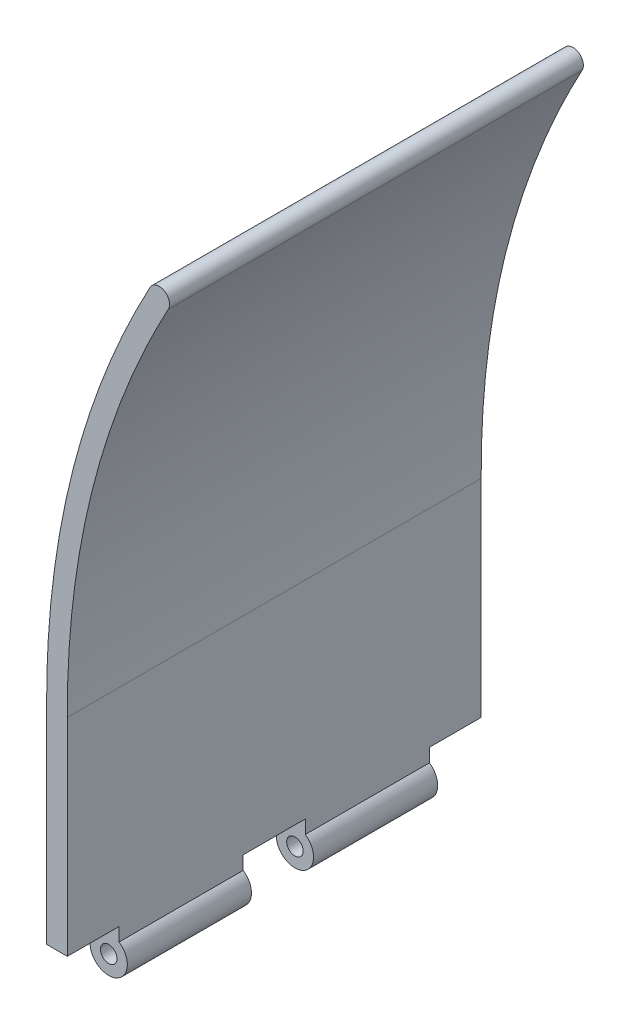
ISO-10303-21;
HEADER;
FILE_DESCRIPTION(('STEP AP214'),'2;1');
FILE_NAME('part.step','',(''),(''),'','','');
FILE_SCHEMA(('AUTOMOTIVE_DESIGN { 1 0 10303 214 1 1 1 1 }'));
ENDSEC;
DATA;
#1=APPLICATION_CONTEXT('core data for automotive mechanical design processes');
#2=APPLICATION_PROTOCOL_DEFINITION('international standard','automotive_design',2000,#1);
#3=PRODUCT_CONTEXT('',#1,'mechanical');
#4=PRODUCT('Part','Part','',(#3));
#5=PRODUCT_RELATED_PRODUCT_CATEGORY('part','',(#4));
#6=PRODUCT_DEFINITION_FORMATION('','',#4);
#7=PRODUCT_DEFINITION_CONTEXT('part definition',#1,'design');
#8=PRODUCT_DEFINITION('design','',#6,#7);
#9=PRODUCT_DEFINITION_SHAPE('','',#8);
#10=(LENGTH_UNIT() NAMED_UNIT(*) SI_UNIT(.MILLI.,.METRE.));
#11=(NAMED_UNIT(*) PLANE_ANGLE_UNIT() SI_UNIT($,.RADIAN.));
#12=(NAMED_UNIT(*) SI_UNIT($,.STERADIAN.) SOLID_ANGLE_UNIT());
#13=UNCERTAINTY_MEASURE_WITH_UNIT(LENGTH_MEASURE(1.E-05),#10,'distance_accuracy_value','');
#14=(GEOMETRIC_REPRESENTATION_CONTEXT(3) GLOBAL_UNCERTAINTY_ASSIGNED_CONTEXT((#13)) GLOBAL_UNIT_ASSIGNED_CONTEXT((#10,
#11,#12)) REPRESENTATION_CONTEXT('',''));
#15=CARTESIAN_POINT('',(0.,0.,0.));
#16=DIRECTION('',(0.,0.,1.));
#17=DIRECTION('',(1.,0.,0.));
#18=AXIS2_PLACEMENT_3D('',#15,#16,#17);
#19=CARTESIAN_POINT('',(0.,0.,50.));
#20=DIRECTION('',(0.,1.,0.));
#21=DIRECTION('',(0.,0.,1.));
#22=AXIS2_PLACEMENT_3D('',#19,#20,#21);
#23=PLANE('',#22);
#24=DIRECTION('',(1.,0.,0.));
#25=VECTOR('',#24,1.);
#26=CARTESIAN_POINT('',(0.,0.,-7.50000000000001));
#27=LINE('',#26,#25);
#28=CARTESIAN_POINT('',(0.,0.,-7.50000000000001));
#29=VERTEX_POINT('',#28);
#30=CARTESIAN_POINT('',(5.,0.,-7.50000000000001));
#31=VERTEX_POINT('',#30);
#32=EDGE_CURVE('E60',#29,#31,#27,.T.);
#33=ORIENTED_EDGE('',*,*,#32,.T.);
#34=DIRECTION('',(0.,0.,-1.));
#35=VECTOR('',#34,1.);
#36=CARTESIAN_POINT('',(5.,0.,50.));
#37=LINE('',#36,#35);
#38=CARTESIAN_POINT('',(5.,0.,7.50000000000001));
#39=VERTEX_POINT('',#38);
#40=EDGE_CURVE('E45',#39,#31,#37,.T.);
#41=ORIENTED_EDGE('',*,*,#40,.F.);
#42=DIRECTION('',(1.,0.,0.));
#43=VECTOR('',#42,1.);
#44=CARTESIAN_POINT('',(0.,0.,7.50000000000001));
#45=LINE('',#44,#43);
#46=CARTESIAN_POINT('',(0.,0.,7.50000000000001));
#47=VERTEX_POINT('',#46);
#48=EDGE_CURVE('E193',#47,#39,#45,.T.);
#49=ORIENTED_EDGE('',*,*,#48,.F.);
#50=DIRECTION('',(0.,0.,-1.));
#51=VECTOR('',#50,1.);
#52=CARTESIAN_POINT('',(0.,0.,50.));
#53=LINE('',#52,#51);
#54=EDGE_CURVE('E419',#47,#29,#53,.T.);
#55=ORIENTED_EDGE('',*,*,#54,.T.);
#56=EDGE_LOOP('',(#33,#41,#49,#55));
#57=FACE_BOUND('',#56,.T.);
#58=ADVANCED_FACE('F37',(#57),#23,.F.);
#59=CARTESIAN_POINT('',(5.,0.,-37.5));
#60=VERTEX_POINT('',#59);
#61=CARTESIAN_POINT('',(5.,0.,-50.));
#62=VERTEX_POINT('',#61);
#63=EDGE_CURVE('E46',#60,#62,#37,.T.);
#64=ORIENTED_EDGE('',*,*,#63,.F.);
#65=DIRECTION('',(1.,0.,0.));
#66=VECTOR('',#65,1.);
#67=CARTESIAN_POINT('',(0.,0.,-37.5));
#68=LINE('',#67,#66);
#69=CARTESIAN_POINT('',(0.,0.,-37.5));
#70=VERTEX_POINT('',#69);
#71=EDGE_CURVE('E177',#70,#60,#68,.T.);
#72=ORIENTED_EDGE('',*,*,#71,.F.);
#73=CARTESIAN_POINT('',(0.,0.,-50.));
#74=VERTEX_POINT('',#73);
#75=EDGE_CURVE('E395',#70,#74,#53,.T.);
#76=ORIENTED_EDGE('',*,*,#75,.T.);
#77=DIRECTION('',(1.,0.,0.));
#78=VECTOR('',#77,1.);
#79=CARTESIAN_POINT('',(0.,0.,-50.));
#80=LINE('',#79,#78);
#81=EDGE_CURVE('E214',#74,#62,#80,.T.);
#82=ORIENTED_EDGE('',*,*,#81,.T.);
#83=EDGE_LOOP('',(#64,#72,#76,#82));
#84=FACE_BOUND('',#83,.T.);
#85=ADVANCED_FACE('F245',(#84),#23,.F.);
#86=CARTESIAN_POINT('',(0.,0.,50.));
#87=VERTEX_POINT('',#86);
#88=CARTESIAN_POINT('',(0.,0.,37.5));
#89=VERTEX_POINT('',#88);
#90=EDGE_CURVE('E416',#87,#89,#53,.T.);
#91=ORIENTED_EDGE('',*,*,#90,.T.);
#92=DIRECTION('',(1.,0.,0.));
#93=VECTOR('',#92,1.);
#94=CARTESIAN_POINT('',(0.,0.,37.5));
#95=LINE('',#94,#93);
#96=CARTESIAN_POINT('',(5.,0.,37.5));
#97=VERTEX_POINT('',#96);
#98=EDGE_CURVE('E208',#89,#97,#95,.T.);
#99=ORIENTED_EDGE('',*,*,#98,.T.);
#100=CARTESIAN_POINT('',(5.,0.,50.));
#101=VERTEX_POINT('',#100);
#102=EDGE_CURVE('E11',#101,#97,#37,.T.);
#103=ORIENTED_EDGE('',*,*,#102,.F.);
#104=DIRECTION('',(1.,0.,0.));
#105=VECTOR('',#104,1.);
#106=CARTESIAN_POINT('',(0.,0.,50.));
#107=LINE('',#106,#105);
#108=EDGE_CURVE('E216',#87,#101,#107,.T.);
#109=ORIENTED_EDGE('',*,*,#108,.F.);
#110=EDGE_LOOP('',(#91,#99,#103,#109));
#111=FACE_BOUND('',#110,.T.);
#112=ADVANCED_FACE('F39',(#111),#23,.F.);
#113=CARTESIAN_POINT('',(5.,0.,50.));
#114=DIRECTION('',(-1.,0.,0.));
#115=DIRECTION('',(0.,-1.,0.));
#116=AXIS2_PLACEMENT_3D('',#113,#114,#115);
#117=PLANE('',#116);
#118=DIRECTION('',(0.,1.,0.));
#119=VECTOR('',#118,1.);
#120=CARTESIAN_POINT('',(5.,0.,-50.));
#121=LINE('',#120,#119);
#122=CARTESIAN_POINT('',(5.,50.0110730492752,-50.));
#123=VERTEX_POINT('',#122);
#124=EDGE_CURVE('E397',#62,#123,#121,.T.);
#125=ORIENTED_EDGE('',*,*,#124,.T.);
#126=DIRECTION('',(0.,0.,-1.));
#127=VECTOR('',#126,1.);
#128=CARTESIAN_POINT('',(5.,50.0110730492752,50.));
#129=LINE('',#128,#127);
#130=CARTESIAN_POINT('',(5.,50.0110730492752,50.));
#131=VERTEX_POINT('',#130);
#132=EDGE_CURVE('E427',#131,#123,#129,.T.);
#133=ORIENTED_EDGE('',*,*,#132,.F.);
#134=DIRECTION('',(0.,1.,0.));
#135=VECTOR('',#134,1.);
#136=CARTESIAN_POINT('',(5.,0.,50.));
#137=LINE('',#136,#135);
#138=EDGE_CURVE('E219',#101,#131,#137,.T.);
#139=ORIENTED_EDGE('',*,*,#138,.F.);
#140=ORIENTED_EDGE('',*,*,#102,.T.);
#141=DIRECTION('',(0.,1.,0.));
#142=VECTOR('',#141,1.);
#143=CARTESIAN_POINT('',(5.,0.,37.5));
#144=LINE('',#143,#142);
#145=CARTESIAN_POINT('',(5.,-3.25834261322607,37.5));
#146=VERTEX_POINT('',#145);
#147=EDGE_CURVE('E205',#146,#97,#144,.T.);
#148=ORIENTED_EDGE('',*,*,#147,.F.);
#149=DIRECTION('',(0.,0.,1.));
#150=VECTOR('',#149,1.);
#151=CARTESIAN_POINT('',(5.,-3.25834261322607,7.50000000000001));
#152=LINE('',#151,#150);
#153=CARTESIAN_POINT('',(5.,-3.25834261322607,7.50000000000001));
#154=VERTEX_POINT('',#153);
#155=EDGE_CURVE('E199',#154,#146,#152,.T.);
#156=ORIENTED_EDGE('',*,*,#155,.F.);
#157=DIRECTION('',(0.,1.,0.));
#158=VECTOR('',#157,1.);
#159=CARTESIAN_POINT('',(5.,0.,7.50000000000001));
#160=LINE('',#159,#158);
#161=EDGE_CURVE('E190',#154,#39,#160,.T.);
#162=ORIENTED_EDGE('',*,*,#161,.T.);
#163=ORIENTED_EDGE('',*,*,#40,.T.);
#164=DIRECTION('',(0.,1.,0.));
#165=VECTOR('',#164,1.);
#166=CARTESIAN_POINT('',(5.,0.,-7.50000000000001));
#167=LINE('',#166,#165);
#168=CARTESIAN_POINT('',(5.,-3.25834261322607,-7.50000000000001));
#169=VERTEX_POINT('',#168);
#170=EDGE_CURVE('E159',#169,#31,#167,.T.);
#171=ORIENTED_EDGE('',*,*,#170,.F.);
#172=DIRECTION('',(0.,0.,-1.));
#173=VECTOR('',#172,1.);
#174=CARTESIAN_POINT('',(5.,-3.25834261322607,-7.50000000000001));
#175=LINE('',#174,#173);
#176=CARTESIAN_POINT('',(5.,-3.25834261322607,-37.5));
#177=VERTEX_POINT('',#176);
#178=EDGE_CURVE('E158',#169,#177,#175,.T.);
#179=ORIENTED_EDGE('',*,*,#178,.T.);
#180=DIRECTION('',(0.,1.,0.));
#181=VECTOR('',#180,1.);
#182=CARTESIAN_POINT('',(5.,0.,-37.5));
#183=LINE('',#182,#181);
#184=EDGE_CURVE('E166',#177,#60,#183,.T.);
#185=ORIENTED_EDGE('',*,*,#184,.T.);
#186=ORIENTED_EDGE('',*,*,#63,.T.);
#187=EDGE_LOOP('',(#125,#133,#139,#140,#148,#156,#162,#163,#171,#179,#185,#186));
#188=FACE_BOUND('',#187,.T.);
#189=ADVANCED_FACE('F237',(#188),#117,.F.);
#190=CARTESIAN_POINT('',(5.,50.0110730492752,50.));
#191=CARTESIAN_POINT('',(4.99042138675413,52.1736585370954,50.));
#192=CARTESIAN_POINT('',(5.03562315373196,56.5115546856775,50.));
#193=CARTESIAN_POINT('',(5.38576478103243,65.0831961631336,50.));
#194=CARTESIAN_POINT('',(6.30882395634368,75.6759616046984,50.));
#195=CARTESIAN_POINT('',(8.19256693434437,88.173154483339,50.));
#196=CARTESIAN_POINT('',(10.852002897865,100.466008633293,50.));
#197=CARTESIAN_POINT('',(14.2878602920185,112.557101091257,50.));
#198=CARTESIAN_POINT('',(18.5006593361396,124.449247630801,50.));
#199=CARTESIAN_POINT('',(22.6625721101704,134.200371846089,50.));
#200=CARTESIAN_POINT('',(26.3790678575615,141.898054896182,50.));
#201=CARTESIAN_POINT('',(28.3749866153581,145.728327363777,50.));
#202=CARTESIAN_POINT('',(29.3988094818618,147.62292719037,50.));
#203=B_SPLINE_CURVE_WITH_KNOTS('',3,(#190,#191,#192,#193,#194,#195,#196,#197,#198,#199,#200,
#201,#202),.UNSPECIFIED.,.F.,.F.,(4,1,1,1,1,1,1,1,1,1,4),(-0.000103873253076061,
0.0624026188252412,0.124909110903558,0.249922095060193,0.374935079216827,0.499948063373462,
0.624961047530096,0.749974031686731,0.874987015843365,0.937493507921683,1.),.UNSPECIFIED.);
#204=DIRECTION('',(0.,0.,-1.));
#205=VECTOR('',#204,1.);
#206=SURFACE_OF_LINEAR_EXTRUSION('',#203,#205);
#207=CARTESIAN_POINT('',(5.,50.0110730492752,-50.));
#208=CARTESIAN_POINT('',(4.99042138675413,52.1736585370954,-50.));
#209=CARTESIAN_POINT('',(5.03562315373196,56.5115546856775,-50.));
#210=CARTESIAN_POINT('',(5.38576478103243,65.0831961631336,-50.));
#211=CARTESIAN_POINT('',(6.30882395634368,75.6759616046984,-50.));
#212=CARTESIAN_POINT('',(8.19256693434437,88.173154483339,-50.));
#213=CARTESIAN_POINT('',(10.852002897865,100.466008633293,-50.));
#214=CARTESIAN_POINT('',(14.2878602920185,112.557101091257,-50.));
#215=CARTESIAN_POINT('',(18.5006593361396,124.449247630801,-50.));
#216=CARTESIAN_POINT('',(22.6625721101704,134.200371846089,-50.));
#217=CARTESIAN_POINT('',(26.3790678575615,141.898054896182,-50.));
#218=CARTESIAN_POINT('',(28.3749866153581,145.728327363777,-50.));
#219=CARTESIAN_POINT('',(29.3988094818618,147.62292719037,-50.));
#220=B_SPLINE_CURVE_WITH_KNOTS('',3,(#207,#208,#209,#210,#211,#212,#213,#214,#215,#216,#217,
#218,#219),.UNSPECIFIED.,.F.,.F.,(4,1,1,1,1,1,1,1,1,1,4),(-0.000103873253076061,
0.0624026188252412,0.124909110903558,0.249922095060193,0.374935079216827,0.499948063373462,
0.624961047530096,0.749974031686731,0.874987015843365,0.937493507921683,1.),.UNSPECIFIED.);
#221=CARTESIAN_POINT('',(29.3988094818618,147.62292719037,-50.));
#222=VERTEX_POINT('',#221);
#223=EDGE_CURVE('E399',#123,#222,#220,.T.);
#224=ORIENTED_EDGE('',*,*,#223,.T.);
#225=DIRECTION('',(0.,0.,-1.));
#226=VECTOR('',#225,1.);
#227=CARTESIAN_POINT('',(29.3988094818618,147.62292719037,50.));
#228=LINE('',#227,#226);
#229=CARTESIAN_POINT('',(29.3988094818618,147.62292719037,50.));
#230=VERTEX_POINT('',#229);
#231=EDGE_CURVE('E425',#230,#222,#228,.T.);
#232=ORIENTED_EDGE('',*,*,#231,.F.);
#233=EDGE_CURVE('E222',#131,#230,#203,.T.);
#234=ORIENTED_EDGE('',*,*,#233,.F.);
#235=ORIENTED_EDGE('',*,*,#132,.T.);
#236=EDGE_LOOP('',(#224,#232,#234,#235));
#237=FACE_BOUND('',#236,.T.);
#238=ADVANCED_FACE('F233',(#237),#206,.F.);
#239=CARTESIAN_POINT('',(27.1994047409309,148.811463595185,50.));
#240=DIRECTION('',(0.,0.,-1.));
#241=DIRECTION('',(-1.,0.,0.));
#242=AXIS2_PLACEMENT_3D('',#239,#240,#241);
#243=CYLINDRICAL_SURFACE('',#242,2.5);
#244=CARTESIAN_POINT('',(27.1994047409309,148.811463595185,-50.));
#245=DIRECTION('',(0.,0.,1.));
#246=DIRECTION('',(1.,0.,0.));
#247=AXIS2_PLACEMENT_3D('',#244,#245,#246);
#248=CIRCLE('',#247,2.5);
#249=CARTESIAN_POINT('',(25.,150.,-50.));
#250=VERTEX_POINT('',#249);
#251=EDGE_CURVE('E403',#222,#250,#248,.T.);
#252=ORIENTED_EDGE('',*,*,#251,.T.);
#253=DIRECTION('',(0.,0.,-1.));
#254=VECTOR('',#253,1.);
#255=CARTESIAN_POINT('',(25.,150.,50.));
#256=LINE('',#255,#254);
#257=CARTESIAN_POINT('',(25.,150.,50.));
#258=VERTEX_POINT('',#257);
#259=EDGE_CURVE('E422',#258,#250,#256,.T.);
#260=ORIENTED_EDGE('',*,*,#259,.F.);
#261=CARTESIAN_POINT('',(27.1994047409309,148.811463595185,50.));
#262=DIRECTION('',(0.,0.,1.));
#263=DIRECTION('',(1.,0.,0.));
#264=AXIS2_PLACEMENT_3D('',#261,#262,#263);
#265=CIRCLE('',#264,2.5);
#266=EDGE_CURVE('E227',#230,#258,#265,.T.);
#267=ORIENTED_EDGE('',*,*,#266,.F.);
#268=ORIENTED_EDGE('',*,*,#231,.T.);
#269=EDGE_LOOP('',(#252,#260,#267,#268));
#270=FACE_BOUND('',#269,.T.);
#271=ADVANCED_FACE('F236',(#270),#243,.T.);
#272=CARTESIAN_POINT('',(25.,150.,50.));
#273=CARTESIAN_POINT('',(-0.236079674561616,103.300249740875,50.));
#274=CARTESIAN_POINT('',(0.,50.,50.));
#275=B_SPLINE_CURVE_WITH_KNOTS('',2,(#272,#273,#274),.UNSPECIFIED.,.F.,.F.,(3,3),(0.,1.),.UNSPECIFIED.);
#276=DIRECTION('',(0.,0.,-1.));
#277=VECTOR('',#276,1.);
#278=SURFACE_OF_LINEAR_EXTRUSION('',#275,#277);
#279=CARTESIAN_POINT('',(25.,150.,-50.));
#280=CARTESIAN_POINT('',(-0.236079674561616,103.300249740875,-50.));
#281=CARTESIAN_POINT('',(0.,50.,-50.));
#282=B_SPLINE_CURVE_WITH_KNOTS('',2,(#279,#280,#281),.UNSPECIFIED.,.F.,.F.,(3,3),(0.,1.),.UNSPECIFIED.);
#283=CARTESIAN_POINT('',(0.,50.,-50.));
#284=VERTEX_POINT('',#283);
#285=EDGE_CURVE('E408',#250,#284,#282,.T.);
#286=ORIENTED_EDGE('',*,*,#285,.T.);
#287=DIRECTION('',(0.,0.,-1.));
#288=VECTOR('',#287,1.);
#289=CARTESIAN_POINT('',(0.,50.,50.));
#290=LINE('',#289,#288);
#291=CARTESIAN_POINT('',(0.,50.,50.));
#292=VERTEX_POINT('',#291);
#293=EDGE_CURVE('E418',#292,#284,#290,.T.);
#294=ORIENTED_EDGE('',*,*,#293,.F.);
#295=EDGE_CURVE('E385',#258,#292,#275,.T.);
#296=ORIENTED_EDGE('',*,*,#295,.F.);
#297=ORIENTED_EDGE('',*,*,#259,.T.);
#298=EDGE_LOOP('',(#286,#294,#296,#297));
#299=FACE_BOUND('',#298,.T.);
#300=ADVANCED_FACE('F330',(#299),#278,.F.);
#301=CARTESIAN_POINT('',(0.,0.,50.));
#302=DIRECTION('',(1.,0.,0.));
#303=DIRECTION('',(0.,0.,-1.));
#304=AXIS2_PLACEMENT_3D('',#301,#302,#303);
#305=PLANE('',#304);
#306=DIRECTION('',(0.,-1.,0.));
#307=VECTOR('',#306,1.);
#308=CARTESIAN_POINT('',(0.,0.,-50.));
#309=LINE('',#308,#307);
#310=EDGE_CURVE('E220',#284,#74,#309,.T.);
#311=ORIENTED_EDGE('',*,*,#310,.T.);
#312=ORIENTED_EDGE('',*,*,#75,.F.);
#313=DIRECTION('',(0.,-1.,0.));
#314=VECTOR('',#313,1.);
#315=CARTESIAN_POINT('',(0.,0.,-37.5));
#316=LINE('',#315,#314);
#317=CARTESIAN_POINT('',(0.,-3.25834261322607,-37.5));
#318=VERTEX_POINT('',#317);
#319=EDGE_CURVE('E154',#70,#318,#316,.T.);
#320=ORIENTED_EDGE('',*,*,#319,.T.);
#321=DIRECTION('',(0.,0.,-1.));
#322=VECTOR('',#321,1.);
#323=CARTESIAN_POINT('',(0.,-3.25834261322607,-7.50000000000001));
#324=LINE('',#323,#322);
#325=CARTESIAN_POINT('',(0.,-3.25834261322607,-7.50000000000001));
#326=VERTEX_POINT('',#325);
#327=EDGE_CURVE('E150',#326,#318,#324,.T.);
#328=ORIENTED_EDGE('',*,*,#327,.F.);
#329=DIRECTION('',(0.,-1.,0.));
#330=VECTOR('',#329,1.);
#331=CARTESIAN_POINT('',(0.,0.,-7.50000000000001));
#332=LINE('',#331,#330);
#333=EDGE_CURVE('E139',#29,#326,#332,.T.);
#334=ORIENTED_EDGE('',*,*,#333,.F.);
#335=ORIENTED_EDGE('',*,*,#54,.F.);
#336=DIRECTION('',(0.,-1.,0.));
#337=VECTOR('',#336,1.);
#338=CARTESIAN_POINT('',(0.,0.,7.50000000000001));
#339=LINE('',#338,#337);
#340=CARTESIAN_POINT('',(0.,-3.25834261322607,7.50000000000001));
#341=VERTEX_POINT('',#340);
#342=EDGE_CURVE('E196',#47,#341,#339,.T.);
#343=ORIENTED_EDGE('',*,*,#342,.T.);
#344=DIRECTION('',(0.,0.,1.));
#345=VECTOR('',#344,1.);
#346=CARTESIAN_POINT('',(0.,-3.25834261322607,7.50000000000001));
#347=LINE('',#346,#345);
#348=CARTESIAN_POINT('',(0.,-3.25834261322607,37.5));
#349=VERTEX_POINT('',#348);
#350=EDGE_CURVE('E212',#341,#349,#347,.T.);
#351=ORIENTED_EDGE('',*,*,#350,.T.);
#352=DIRECTION('',(0.,-1.,0.));
#353=VECTOR('',#352,1.);
#354=CARTESIAN_POINT('',(0.,0.,37.5));
#355=LINE('',#354,#353);
#356=EDGE_CURVE('E187',#89,#349,#355,.T.);
#357=ORIENTED_EDGE('',*,*,#356,.F.);
#358=ORIENTED_EDGE('',*,*,#90,.F.);
#359=DIRECTION('',(0.,-1.,0.));
#360=VECTOR('',#359,1.);
#361=CARTESIAN_POINT('',(0.,0.,50.));
#362=LINE('',#361,#360);
#363=EDGE_CURVE('E390',#292,#87,#362,.T.);
#364=ORIENTED_EDGE('',*,*,#363,.F.);
#365=ORIENTED_EDGE('',*,*,#293,.T.);
#366=EDGE_LOOP('',(#311,#312,#320,#328,#334,#335,#343,#351,#357,#358,#364,#365));
#367=FACE_BOUND('',#366,.T.);
#368=ADVANCED_FACE('F152',(#367),#305,.F.);
#369=CARTESIAN_POINT('',(10.9814064696372,100.432381684628,50.));
#370=DIRECTION('',(0.,0.,1.));
#371=DIRECTION('',(1.,0.,0.));
#372=AXIS2_PLACEMENT_3D('',#369,#370,#371);
#373=PLANE('',#372);
#374=ORIENTED_EDGE('',*,*,#108,.T.);
#375=ORIENTED_EDGE('',*,*,#138,.T.);
#376=ORIENTED_EDGE('',*,*,#233,.T.);
#377=ORIENTED_EDGE('',*,*,#266,.T.);
#378=ORIENTED_EDGE('',*,*,#295,.T.);
#379=ORIENTED_EDGE('',*,*,#363,.T.);
#380=EDGE_LOOP('',(#374,#375,#376,#377,#378,#379));
#381=FACE_BOUND('',#380,.T.);
#382=ADVANCED_FACE('F329',(#381),#373,.T.);
#383=CARTESIAN_POINT('',(10.9814064696372,100.432381684628,-50.));
#384=DIRECTION('',(0.,0.,1.));
#385=DIRECTION('',(1.,0.,0.));
#386=AXIS2_PLACEMENT_3D('',#383,#384,#385);
#387=PLANE('',#386);
#388=ORIENTED_EDGE('',*,*,#81,.F.);
#389=ORIENTED_EDGE('',*,*,#310,.F.);
#390=ORIENTED_EDGE('',*,*,#285,.F.);
#391=ORIENTED_EDGE('',*,*,#251,.F.);
#392=ORIENTED_EDGE('',*,*,#223,.F.);
#393=ORIENTED_EDGE('',*,*,#124,.F.);
#394=EDGE_LOOP('',(#388,#389,#390,#391,#392,#393));
#395=FACE_BOUND('',#394,.T.);
#396=ADVANCED_FACE('F264',(#395),#387,.F.);
#397=CARTESIAN_POINT('',(2.5,-7.,7.50000000000001));
#398=DIRECTION('',(0.,0.,1.));
#399=DIRECTION('',(1.,0.,0.));
#400=AXIS2_PLACEMENT_3D('',#397,#398,#399);
#401=CYLINDRICAL_SURFACE('',#400,4.49999999999999);
#402=CARTESIAN_POINT('',(2.5,-7.,37.5));
#403=DIRECTION('',(0.,0.,1.));
#404=DIRECTION('',(1.,0.,0.));
#405=AXIS2_PLACEMENT_3D('',#402,#403,#404);
#406=CIRCLE('',#405,4.49999999999999);
#407=EDGE_CURVE('E202',#349,#146,#406,.T.);
#408=ORIENTED_EDGE('',*,*,#407,.F.);
#409=ORIENTED_EDGE('',*,*,#350,.F.);
#410=CARTESIAN_POINT('',(2.5,-7.,7.50000000000001));
#411=DIRECTION('',(0.,0.,1.));
#412=DIRECTION('',(1.,0.,0.));
#413=AXIS2_PLACEMENT_3D('',#410,#411,#412);
#414=CIRCLE('',#413,4.49999999999999);
#415=EDGE_CURVE('E186',#341,#154,#414,.T.);
#416=ORIENTED_EDGE('',*,*,#415,.T.);
#417=ORIENTED_EDGE('',*,*,#155,.T.);
#418=EDGE_LOOP('',(#408,#409,#416,#417));
#419=FACE_BOUND('',#418,.T.);
#420=ADVANCED_FACE('F269',(#419),#401,.T.);
#421=CARTESIAN_POINT('',(2.5,-7.,7.50000000000001));
#422=DIRECTION('',(0.,0.,1.));
#423=DIRECTION('',(1.,0.,0.));
#424=AXIS2_PLACEMENT_3D('',#421,#422,#423);
#425=CYLINDRICAL_SURFACE('',#424,2.);
#426=CARTESIAN_POINT('',(2.5,-7.,7.50000000000001));
#427=DIRECTION('',(0.,0.,1.));
#428=DIRECTION('',(1.,0.,0.));
#429=AXIS2_PLACEMENT_3D('',#426,#427,#428);
#430=CIRCLE('',#429,2.);
#431=CARTESIAN_POINT('',(4.5,-7.,7.50000000000001));
#432=VERTEX_POINT('',#431);
#433=EDGE_CURVE('E183',#432,#432,#430,.T.);
#434=ORIENTED_EDGE('',*,*,#433,.F.);
#435=EDGE_LOOP('',(#434));
#436=FACE_BOUND('',#435,.T.);
#437=CARTESIAN_POINT('',(2.5,-7.,37.5));
#438=DIRECTION('',(0.,0.,1.));
#439=DIRECTION('',(1.,0.,0.));
#440=AXIS2_PLACEMENT_3D('',#437,#438,#439);
#441=CIRCLE('',#440,2.);
#442=CARTESIAN_POINT('',(4.5,-7.,37.5));
#443=VERTEX_POINT('',#442);
#444=EDGE_CURVE('E181',#443,#443,#441,.T.);
#445=ORIENTED_EDGE('',*,*,#444,.T.);
#446=EDGE_LOOP('',(#445));
#447=FACE_BOUND('',#446,.T.);
#448=ADVANCED_FACE('F274',(#436,#447),#425,.F.);
#449=CARTESIAN_POINT('',(0.,0.,7.50000000000001));
#450=DIRECTION('',(0.,0.,1.));
#451=DIRECTION('',(1.,0.,0.));
#452=AXIS2_PLACEMENT_3D('',#449,#450,#451);
#453=PLANE('',#452);
#454=ORIENTED_EDGE('',*,*,#433,.T.);
#455=EDGE_LOOP('',(#454));
#456=FACE_BOUND('',#455,.T.);
#457=ORIENTED_EDGE('',*,*,#415,.F.);
#458=ORIENTED_EDGE('',*,*,#342,.F.);
#459=ORIENTED_EDGE('',*,*,#48,.T.);
#460=ORIENTED_EDGE('',*,*,#161,.F.);
#461=EDGE_LOOP('',(#457,#458,#459,#460));
#462=FACE_BOUND('',#461,.T.);
#463=ADVANCED_FACE('F285',(#456,#462),#453,.F.);
#464=CARTESIAN_POINT('',(0.,0.,37.5));
#465=DIRECTION('',(0.,0.,1.));
#466=DIRECTION('',(1.,0.,0.));
#467=AXIS2_PLACEMENT_3D('',#464,#465,#466);
#468=PLANE('',#467);
#469=ORIENTED_EDGE('',*,*,#444,.F.);
#470=EDGE_LOOP('',(#469));
#471=FACE_BOUND('',#470,.T.);
#472=ORIENTED_EDGE('',*,*,#407,.T.);
#473=ORIENTED_EDGE('',*,*,#147,.T.);
#474=ORIENTED_EDGE('',*,*,#98,.F.);
#475=ORIENTED_EDGE('',*,*,#356,.T.);
#476=EDGE_LOOP('',(#472,#473,#474,#475));
#477=FACE_BOUND('',#476,.T.);
#478=ADVANCED_FACE('F296',(#471,#477),#468,.T.);
#479=CARTESIAN_POINT('',(2.5,-7.,-7.50000000000001));
#480=DIRECTION('',(0.,0.,-1.));
#481=DIRECTION('',(-1.,0.,0.));
#482=AXIS2_PLACEMENT_3D('',#479,#480,#481);
#483=CYLINDRICAL_SURFACE('',#482,4.49999999999999);
#484=CARTESIAN_POINT('',(2.5,-7.,-37.5));
#485=DIRECTION('',(0.,0.,1.));
#486=DIRECTION('',(1.,0.,0.));
#487=AXIS2_PLACEMENT_3D('',#484,#485,#486);
#488=CIRCLE('',#487,4.49999999999999);
#489=EDGE_CURVE('E174',#318,#177,#488,.T.);
#490=ORIENTED_EDGE('',*,*,#489,.T.);
#491=ORIENTED_EDGE('',*,*,#178,.F.);
#492=CARTESIAN_POINT('',(2.5,-7.,-7.50000000000001));
#493=DIRECTION('',(0.,0.,1.));
#494=DIRECTION('',(1.,0.,0.));
#495=AXIS2_PLACEMENT_3D('',#492,#493,#494);
#496=CIRCLE('',#495,4.49999999999999);
#497=EDGE_CURVE('E144',#326,#169,#496,.T.);
#498=ORIENTED_EDGE('',*,*,#497,.F.);
#499=ORIENTED_EDGE('',*,*,#327,.T.);
#500=EDGE_LOOP('',(#490,#491,#498,#499));
#501=FACE_BOUND('',#500,.T.);
#502=ADVANCED_FACE('F161',(#501),#483,.T.);
#503=CARTESIAN_POINT('',(2.5,-7.,-7.50000000000001));
#504=DIRECTION('',(0.,0.,-1.));
#505=DIRECTION('',(-1.,0.,0.));
#506=AXIS2_PLACEMENT_3D('',#503,#504,#505);
#507=CYLINDRICAL_SURFACE('',#506,2.);
#508=CARTESIAN_POINT('',(2.5,-7.,-7.50000000000001));
#509=DIRECTION('',(0.,0.,1.));
#510=DIRECTION('',(1.,0.,0.));
#511=AXIS2_PLACEMENT_3D('',#508,#509,#510);
#512=CIRCLE('',#511,2.);
#513=CARTESIAN_POINT('',(4.5,-7.,-7.50000000000001));
#514=VERTEX_POINT('',#513);
#515=EDGE_CURVE('E163',#514,#514,#512,.T.);
#516=ORIENTED_EDGE('',*,*,#515,.T.);
#517=EDGE_LOOP('',(#516));
#518=FACE_BOUND('',#517,.T.);
#519=CARTESIAN_POINT('',(2.5,-7.,-37.5));
#520=DIRECTION('',(0.,0.,1.));
#521=DIRECTION('',(1.,0.,0.));
#522=AXIS2_PLACEMENT_3D('',#519,#520,#521);
#523=CIRCLE('',#522,2.);
#524=CARTESIAN_POINT('',(4.5,-7.,-37.5));
#525=VERTEX_POINT('',#524);
#526=EDGE_CURVE('E171',#525,#525,#523,.T.);
#527=ORIENTED_EDGE('',*,*,#526,.F.);
#528=EDGE_LOOP('',(#527));
#529=FACE_BOUND('',#528,.T.);
#530=ADVANCED_FACE('F340',(#518,#529),#507,.F.);
#531=CARTESIAN_POINT('',(0.,0.,-7.50000000000001));
#532=DIRECTION('',(0.,0.,-1.));
#533=DIRECTION('',(1.,0.,0.));
#534=AXIS2_PLACEMENT_3D('',#531,#532,#533);
#535=PLANE('',#534);
#536=ORIENTED_EDGE('',*,*,#515,.F.);
#537=EDGE_LOOP('',(#536));
#538=FACE_BOUND('',#537,.T.);
#539=ORIENTED_EDGE('',*,*,#497,.T.);
#540=ORIENTED_EDGE('',*,*,#170,.T.);
#541=ORIENTED_EDGE('',*,*,#32,.F.);
#542=ORIENTED_EDGE('',*,*,#333,.T.);
#543=EDGE_LOOP('',(#539,#540,#541,#542));
#544=FACE_BOUND('',#543,.T.);
#545=ADVANCED_FACE('F141',(#538,#544),#535,.F.);
#546=CARTESIAN_POINT('',(0.,0.,-37.5));
#547=DIRECTION('',(0.,0.,-1.));
#548=DIRECTION('',(1.,0.,0.));
#549=AXIS2_PLACEMENT_3D('',#546,#547,#548);
#550=PLANE('',#549);
#551=ORIENTED_EDGE('',*,*,#526,.T.);
#552=EDGE_LOOP('',(#551));
#553=FACE_BOUND('',#552,.T.);
#554=ORIENTED_EDGE('',*,*,#489,.F.);
#555=ORIENTED_EDGE('',*,*,#319,.F.);
#556=ORIENTED_EDGE('',*,*,#71,.T.);
#557=ORIENTED_EDGE('',*,*,#184,.F.);
#558=EDGE_LOOP('',(#554,#555,#556,#557));
#559=FACE_BOUND('',#558,.T.);
#560=ADVANCED_FACE('F356',(#553,#559),#550,.T.);
#561=CLOSED_SHELL('',(#58,#85,#112,#189,#238,#271,#300,#368,#382,#396,#420,#448,#463,#478,#502,
#530,#545,#560));
#562=MANIFOLD_SOLID_BREP('B2',#561);
#563=ADVANCED_BREP_SHAPE_REPRESENTATION('',(#18,#562),#14);
#564=SHAPE_DEFINITION_REPRESENTATION(#9,#563);
ENDSEC;
END-ISO-10303-21;
